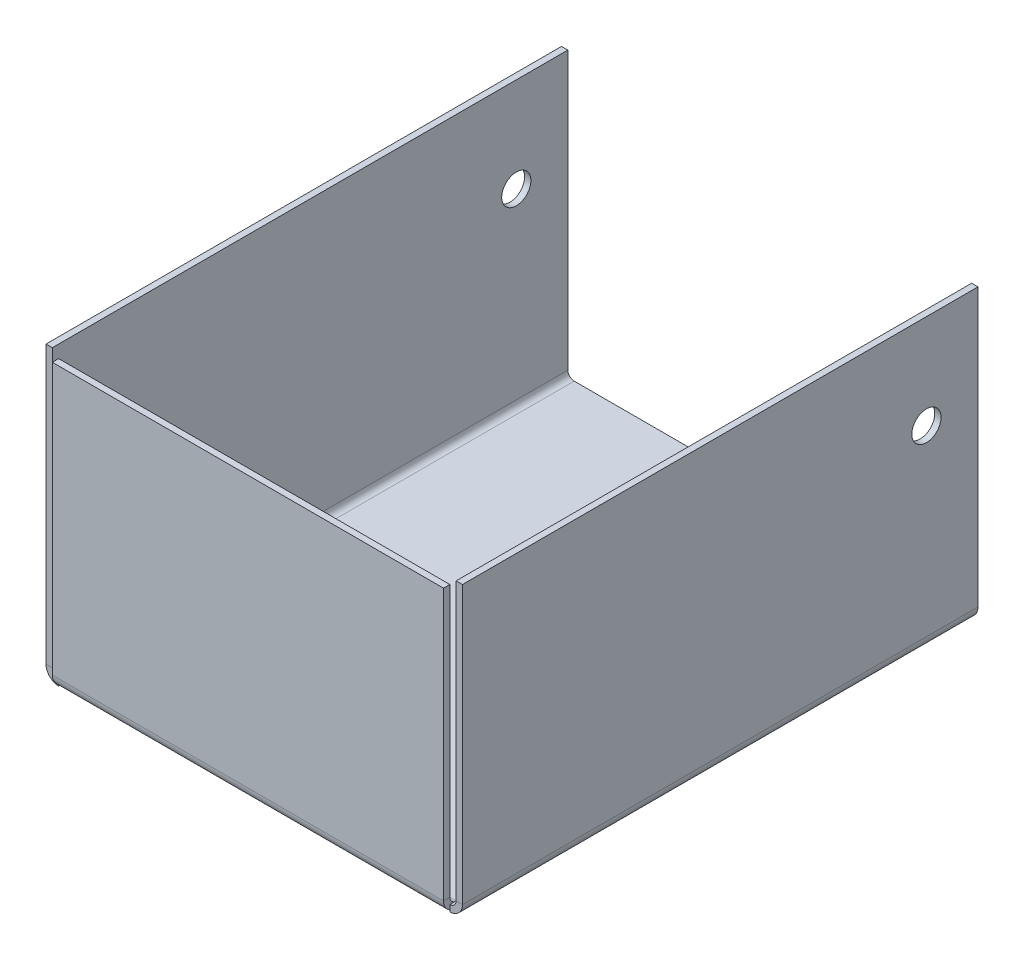
ISO-10303-21;
HEADER;
FILE_DESCRIPTION(('STEP AP214'),'2;1');
FILE_NAME('part.step','',(''),(''),'','','');
FILE_SCHEMA(('AUTOMOTIVE_DESIGN { 1 0 10303 214 1 1 1 1 }'));
ENDSEC;
DATA;
#1=APPLICATION_CONTEXT('core data for automotive mechanical design processes');
#2=APPLICATION_PROTOCOL_DEFINITION('international standard','automotive_design',2000,#1);
#3=PRODUCT_CONTEXT('',#1,'mechanical');
#4=PRODUCT('Part','Part','',(#3));
#5=PRODUCT_RELATED_PRODUCT_CATEGORY('part','',(#4));
#6=PRODUCT_DEFINITION_FORMATION('','',#4);
#7=PRODUCT_DEFINITION_CONTEXT('part definition',#1,'design');
#8=PRODUCT_DEFINITION('design','',#6,#7);
#9=PRODUCT_DEFINITION_SHAPE('','',#8);
#10=(LENGTH_UNIT() NAMED_UNIT(*) SI_UNIT(.MILLI.,.METRE.));
#11=(NAMED_UNIT(*) PLANE_ANGLE_UNIT() SI_UNIT($,.RADIAN.));
#12=(NAMED_UNIT(*) SI_UNIT($,.STERADIAN.) SOLID_ANGLE_UNIT());
#13=UNCERTAINTY_MEASURE_WITH_UNIT(LENGTH_MEASURE(1.E-05),#10,'distance_accuracy_value','');
#14=(GEOMETRIC_REPRESENTATION_CONTEXT(3) GLOBAL_UNCERTAINTY_ASSIGNED_CONTEXT((#13)) GLOBAL_UNIT_ASSIGNED_CONTEXT((#10,
#11,#12)) REPRESENTATION_CONTEXT('',''));
#15=CARTESIAN_POINT('',(0.,0.,0.));
#16=DIRECTION('',(0.,0.,1.));
#17=DIRECTION('',(1.,0.,0.));
#18=AXIS2_PLACEMENT_3D('',#15,#16,#17);
#19=CARTESIAN_POINT('',(22.7634,0.,30.));
#20=DIRECTION('',(-1.,0.,0.));
#21=DIRECTION('',(0.,0.,1.));
#22=AXIS2_PLACEMENT_3D('',#19,#20,#21);
#23=PLANE('',#22);
#24=DIRECTION('',(0.,1.,0.));
#25=VECTOR('',#24,1.);
#26=CARTESIAN_POINT('',(22.7634,-0.7366,30.));
#27=LINE('',#26,#25);
#28=CARTESIAN_POINT('',(22.7634,-0.7366,30.));
#29=VERTEX_POINT('',#28);
#30=CARTESIAN_POINT('',(22.7634,-0.539228624855236,30.));
#31=VERTEX_POINT('',#30);
#32=EDGE_CURVE('E350',#29,#31,#27,.T.);
#33=ORIENTED_EDGE('',*,*,#32,.T.);
#34=CARTESIAN_POINT('',(22.7634,0.736599999999997,29.2634));
#35=DIRECTION('',(1.,0.,0.));
#36=DIRECTION('',(0.,0.,-1.));
#37=AXIS2_PLACEMENT_3D('',#34,#35,#36);
#38=CIRCLE('',#37,1.4732);
#39=CARTESIAN_POINT('',(22.7634,-0.7366,29.2634));
#40=VERTEX_POINT('',#39);
#41=EDGE_CURVE('E11',#31,#40,#38,.T.);
#42=ORIENTED_EDGE('',*,*,#41,.T.);
#43=DIRECTION('',(0.,0.,-1.));
#44=VECTOR('',#43,1.);
#45=CARTESIAN_POINT('',(22.7634,-0.7366,30.));
#46=LINE('',#45,#44);
#47=EDGE_CURVE('E321',#29,#40,#46,.T.);
#48=ORIENTED_EDGE('',*,*,#47,.F.);
#49=EDGE_LOOP('',(#33,#42,#48));
#50=FACE_BOUND('',#49,.T.);
#51=ADVANCED_FACE('F41',(#50),#23,.T.);
#52=CARTESIAN_POINT('',(-22.7634,0.,29.2634));
#53=DIRECTION('',(1.,0.,0.));
#54=DIRECTION('',(0.,0.,-1.));
#55=AXIS2_PLACEMENT_3D('',#52,#53,#54);
#56=PLANE('',#55);
#57=DIRECTION('',(0.,0.,-1.));
#58=VECTOR('',#57,1.);
#59=CARTESIAN_POINT('',(-22.7634,-0.7366,30.));
#60=LINE('',#59,#58);
#61=CARTESIAN_POINT('',(-22.7634,-0.7366,30.));
#62=VERTEX_POINT('',#61);
#63=CARTESIAN_POINT('',(-22.7634,-0.7366,29.2634));
#64=VERTEX_POINT('',#63);
#65=EDGE_CURVE('E325',#62,#64,#60,.T.);
#66=ORIENTED_EDGE('',*,*,#65,.T.);
#67=CARTESIAN_POINT('',(-22.7634,0.736599999999997,29.2634));
#68=DIRECTION('',(1.,0.,0.));
#69=DIRECTION('',(0.,0.,-1.));
#70=AXIS2_PLACEMENT_3D('',#67,#68,#69);
#71=CIRCLE('',#70,1.4732);
#72=CARTESIAN_POINT('',(-22.7634,-0.539228624855236,30.));
#73=VERTEX_POINT('',#72);
#74=EDGE_CURVE('E230',#64,#73,#71,.F.);
#75=ORIENTED_EDGE('',*,*,#74,.T.);
#76=DIRECTION('',(0.,-1.,0.));
#77=VECTOR('',#76,1.);
#78=CARTESIAN_POINT('',(-22.7634,0.,30.));
#79=LINE('',#78,#77);
#80=EDGE_CURVE('E341',#73,#62,#79,.T.);
#81=ORIENTED_EDGE('',*,*,#80,.T.);
#82=EDGE_LOOP('',(#66,#75,#81));
#83=FACE_BOUND('',#82,.T.);
#84=ADVANCED_FACE('F400',(#83),#56,.T.);
#85=CARTESIAN_POINT('',(-23.5,-0.7366,30.));
#86=DIRECTION('',(0.,-1.,0.));
#87=DIRECTION('',(0.,0.,-1.));
#88=AXIS2_PLACEMENT_3D('',#85,#86,#87);
#89=PLANE('',#88);
#90=CARTESIAN_POINT('',(0.,-0.7366,-6.5));
#91=DIRECTION('',(0.,-1.,0.));
#92=DIRECTION('',(0.,0.,-1.));
#93=AXIS2_PLACEMENT_3D('',#90,#91,#92);
#94=CIRCLE('',#93,3.);
#95=CARTESIAN_POINT('',(0.,-0.7366,-9.5));
#96=VERTEX_POINT('',#95);
#97=EDGE_CURVE('E821',#96,#96,#94,.T.);
#98=ORIENTED_EDGE('',*,*,#97,.F.);
#99=EDGE_LOOP('',(#98));
#100=FACE_BOUND('',#99,.T.);
#101=CARTESIAN_POINT('',(22.7634,-0.7366,-30.));
#102=VERTEX_POINT('',#101);
#103=EDGE_CURVE('E320',#40,#102,#46,.T.);
#104=ORIENTED_EDGE('',*,*,#103,.F.);
#105=DIRECTION('',(1.,0.,0.));
#106=VECTOR('',#105,1.);
#107=CARTESIAN_POINT('',(22.7634,-0.7366,29.2634));
#108=LINE('',#107,#106);
#109=EDGE_CURVE('E184',#40,#64,#108,.F.);
#110=ORIENTED_EDGE('',*,*,#109,.T.);
#111=CARTESIAN_POINT('',(-22.7634,-0.7366,-30.));
#112=VERTEX_POINT('',#111);
#113=EDGE_CURVE('E324',#64,#112,#60,.T.);
#114=ORIENTED_EDGE('',*,*,#113,.T.);
#115=DIRECTION('',(1.,0.,0.));
#116=VECTOR('',#115,1.);
#117=CARTESIAN_POINT('',(-23.5,-0.7366,-30.));
#118=LINE('',#117,#116);
#119=EDGE_CURVE('E281',#102,#112,#118,.F.);
#120=ORIENTED_EDGE('',*,*,#119,.F.);
#121=EDGE_LOOP('',(#104,#110,#114,#120));
#122=FACE_BOUND('',#121,.T.);
#123=ADVANCED_FACE('F406',(#100,#122),#89,.T.);
#124=CARTESIAN_POINT('',(-23.5,0.,30.));
#125=DIRECTION('',(0.,-1.,0.));
#126=DIRECTION('',(0.,0.,-1.));
#127=AXIS2_PLACEMENT_3D('',#124,#125,#126);
#128=PLANE('',#127);
#129=CARTESIAN_POINT('',(0.,0.,-6.5));
#130=DIRECTION('',(0.,-1.,0.));
#131=DIRECTION('',(0.,0.,-1.));
#132=AXIS2_PLACEMENT_3D('',#129,#130,#131);
#133=CIRCLE('',#132,3.);
#134=CARTESIAN_POINT('',(0.,0.,-9.5));
#135=VERTEX_POINT('',#134);
#136=EDGE_CURVE('E45',#135,#135,#133,.T.);
#137=ORIENTED_EDGE('',*,*,#136,.T.);
#138=EDGE_LOOP('',(#137));
#139=FACE_BOUND('',#138,.T.);
#140=DIRECTION('',(1.,0.,0.));
#141=VECTOR('',#140,1.);
#142=CARTESIAN_POINT('',(22.7634,0.,29.2634));
#143=LINE('',#142,#141);
#144=CARTESIAN_POINT('',(22.7634,0.,29.2634));
#145=VERTEX_POINT('',#144);
#146=CARTESIAN_POINT('',(-22.7634,0.,29.2634));
#147=VERTEX_POINT('',#146);
#148=EDGE_CURVE('E236',#145,#147,#143,.F.);
#149=ORIENTED_EDGE('',*,*,#148,.F.);
#150=DIRECTION('',(0.,0.,-1.));
#151=VECTOR('',#150,1.);
#152=CARTESIAN_POINT('',(22.7634,0.,30.));
#153=LINE('',#152,#151);
#154=CARTESIAN_POINT('',(22.7634,0.,-30.));
#155=VERTEX_POINT('',#154);
#156=EDGE_CURVE('E307',#145,#155,#153,.T.);
#157=ORIENTED_EDGE('',*,*,#156,.T.);
#158=DIRECTION('',(-1.,0.,0.));
#159=VECTOR('',#158,1.);
#160=CARTESIAN_POINT('',(-23.5,0.,-30.));
#161=LINE('',#160,#159);
#162=CARTESIAN_POINT('',(-22.7634,0.,-30.));
#163=VERTEX_POINT('',#162);
#164=EDGE_CURVE('E299',#155,#163,#161,.T.);
#165=ORIENTED_EDGE('',*,*,#164,.T.);
#166=DIRECTION('',(0.,0.,-1.));
#167=VECTOR('',#166,1.);
#168=CARTESIAN_POINT('',(-22.7634,0.,30.));
#169=LINE('',#168,#167);
#170=EDGE_CURVE('E67',#147,#163,#169,.T.);
#171=ORIENTED_EDGE('',*,*,#170,.F.);
#172=EDGE_LOOP('',(#149,#157,#165,#171));
#173=FACE_BOUND('',#172,.T.);
#174=ADVANCED_FACE('F424',(#139,#173),#128,.F.);
#175=CARTESIAN_POINT('',(23.5,0.7366,30.));
#176=DIRECTION('',(0.,0.,1.));
#177=DIRECTION('',(1.,0.,0.));
#178=AXIS2_PLACEMENT_3D('',#175,#176,#177);
#179=PLANE('',#178);
#180=DIRECTION('',(1.,0.,0.));
#181=VECTOR('',#180,1.);
#182=CARTESIAN_POINT('',(23.5,0.7366,30.));
#183=LINE('',#182,#181);
#184=CARTESIAN_POINT('',(23.5,0.7366,30.));
#185=VERTEX_POINT('',#184);
#186=CARTESIAN_POINT('',(24.2366,0.7366,30.));
#187=VERTEX_POINT('',#186);
#188=EDGE_CURVE('E50',#185,#187,#183,.T.);
#189=ORIENTED_EDGE('',*,*,#188,.F.);
#190=CARTESIAN_POINT('',(22.7634,0.7366,30.));
#191=DIRECTION('',(0.,0.,1.));
#192=DIRECTION('',(1.,0.,0.));
#193=AXIS2_PLACEMENT_3D('',#190,#191,#192);
#194=CIRCLE('',#193,0.7366);
#195=CARTESIAN_POINT('',(22.7634,0.,30.));
#196=VERTEX_POINT('',#195);
#197=EDGE_CURVE('E264',#185,#196,#194,.F.);
#198=ORIENTED_EDGE('',*,*,#197,.T.);
#199=EDGE_CURVE('E59',#31,#196,#27,.T.);
#200=ORIENTED_EDGE('',*,*,#199,.F.);
#201=ORIENTED_EDGE('',*,*,#32,.F.);
#202=CARTESIAN_POINT('',(22.7634,0.7366,30.));
#203=DIRECTION('',(0.,0.,1.));
#204=DIRECTION('',(1.,0.,0.));
#205=AXIS2_PLACEMENT_3D('',#202,#203,#204);
#206=CIRCLE('',#205,1.4732);
#207=EDGE_CURVE('E252',#187,#29,#206,.F.);
#208=ORIENTED_EDGE('',*,*,#207,.F.);
#209=EDGE_LOOP('',(#189,#198,#200,#201,#208));
#210=FACE_BOUND('',#209,.T.);
#211=ADVANCED_FACE('F43',(#210),#179,.T.);
#212=CARTESIAN_POINT('',(22.7634,-0.7366,30.));
#213=DIRECTION('',(0.,0.,1.));
#214=DIRECTION('',(1.,0.,0.));
#215=AXIS2_PLACEMENT_3D('',#212,#213,#214);
#216=PLANE('',#215);
#217=DIRECTION('',(0.,-1.,0.));
#218=VECTOR('',#217,1.);
#219=CARTESIAN_POINT('',(23.5,0.,30.));
#220=LINE('',#219,#218);
#221=CARTESIAN_POINT('',(23.5,33.,30.));
#222=VERTEX_POINT('',#221);
#223=EDGE_CURVE('E261',#222,#185,#220,.T.);
#224=ORIENTED_EDGE('',*,*,#223,.T.);
#225=ORIENTED_EDGE('',*,*,#188,.T.);
#226=DIRECTION('',(0.,-1.,0.));
#227=VECTOR('',#226,1.);
#228=CARTESIAN_POINT('',(24.2366,0.,30.));
#229=LINE('',#228,#227);
#230=CARTESIAN_POINT('',(24.2366,33.,30.));
#231=VERTEX_POINT('',#230);
#232=EDGE_CURVE('E255',#231,#187,#229,.T.);
#233=ORIENTED_EDGE('',*,*,#232,.F.);
#234=DIRECTION('',(1.,0.,0.));
#235=VECTOR('',#234,1.);
#236=CARTESIAN_POINT('',(23.5,33.,30.));
#237=LINE('',#236,#235);
#238=EDGE_CURVE('E258',#222,#231,#237,.T.);
#239=ORIENTED_EDGE('',*,*,#238,.F.);
#240=EDGE_LOOP('',(#224,#225,#233,#239));
#241=FACE_BOUND('',#240,.T.);
#242=ADVANCED_FACE('F482',(#241),#216,.T.);
#243=CARTESIAN_POINT('',(22.7634,0.,-30.));
#244=DIRECTION('',(0.,0.,-1.));
#245=DIRECTION('',(-1.,0.,0.));
#246=AXIS2_PLACEMENT_3D('',#243,#244,#245);
#247=PLANE('',#246);
#248=DIRECTION('',(0.,-1.,0.));
#249=VECTOR('',#248,1.);
#250=CARTESIAN_POINT('',(22.7634,0.,-30.));
#251=LINE('',#250,#249);
#252=EDGE_CURVE('E347',#155,#102,#251,.T.);
#253=ORIENTED_EDGE('',*,*,#252,.F.);
#254=CARTESIAN_POINT('',(22.7634,0.7366,-30.));
#255=DIRECTION('',(0.,0.,1.));
#256=DIRECTION('',(1.,0.,0.));
#257=AXIS2_PLACEMENT_3D('',#254,#255,#256);
#258=CIRCLE('',#257,0.7366);
#259=CARTESIAN_POINT('',(23.5,0.7366,-30.));
#260=VERTEX_POINT('',#259);
#261=EDGE_CURVE('E296',#260,#155,#258,.F.);
#262=ORIENTED_EDGE('',*,*,#261,.F.);
#263=DIRECTION('',(-1.,0.,0.));
#264=VECTOR('',#263,1.);
#265=CARTESIAN_POINT('',(24.2366,0.7366,-30.));
#266=LINE('',#265,#264);
#267=CARTESIAN_POINT('',(24.2366,0.7366,-30.));
#268=VERTEX_POINT('',#267);
#269=EDGE_CURVE('E345',#268,#260,#266,.T.);
#270=ORIENTED_EDGE('',*,*,#269,.F.);
#271=CARTESIAN_POINT('',(22.7634,0.7366,-30.));
#272=DIRECTION('',(0.,0.,1.));
#273=DIRECTION('',(1.,0.,0.));
#274=AXIS2_PLACEMENT_3D('',#271,#272,#273);
#275=CIRCLE('',#274,1.4732);
#276=EDGE_CURVE('E284',#268,#102,#275,.F.);
#277=ORIENTED_EDGE('',*,*,#276,.T.);
#278=EDGE_LOOP('',(#253,#262,#270,#277));
#279=FACE_BOUND('',#278,.T.);
#280=ADVANCED_FACE('F479',(#279),#247,.T.);
#281=CARTESIAN_POINT('',(24.2366,0.7366,-30.));
#282=DIRECTION('',(0.,0.,-1.));
#283=DIRECTION('',(-1.,0.,0.));
#284=AXIS2_PLACEMENT_3D('',#281,#282,#283);
#285=PLANE('',#284);
#286=ORIENTED_EDGE('',*,*,#164,.F.);
#287=ORIENTED_EDGE('',*,*,#252,.T.);
#288=ORIENTED_EDGE('',*,*,#119,.T.);
#289=DIRECTION('',(0.,1.,0.));
#290=VECTOR('',#289,1.);
#291=CARTESIAN_POINT('',(-22.7634,-0.7366,-30.));
#292=LINE('',#291,#290);
#293=EDGE_CURVE('E334',#112,#163,#292,.T.);
#294=ORIENTED_EDGE('',*,*,#293,.T.);
#295=EDGE_LOOP('',(#286,#287,#288,#294));
#296=FACE_BOUND('',#295,.T.);
#297=ADVANCED_FACE('F475',(#296),#285,.T.);
#298=CARTESIAN_POINT('',(-22.7634,0.,30.));
#299=DIRECTION('',(0.,0.,1.));
#300=DIRECTION('',(1.,0.,0.));
#301=AXIS2_PLACEMENT_3D('',#298,#299,#300);
#302=PLANE('',#301);
#303=CARTESIAN_POINT('',(-22.7634,0.,30.));
#304=VERTEX_POINT('',#303);
#305=EDGE_CURVE('E342',#304,#73,#79,.T.);
#306=ORIENTED_EDGE('',*,*,#305,.F.);
#307=CARTESIAN_POINT('',(-22.7634,0.7366,30.));
#308=DIRECTION('',(0.,0.,1.));
#309=DIRECTION('',(1.,0.,0.));
#310=AXIS2_PLACEMENT_3D('',#307,#308,#309);
#311=CIRCLE('',#310,0.7366);
#312=CARTESIAN_POINT('',(-23.5,0.7366,30.));
#313=VERTEX_POINT('',#312);
#314=EDGE_CURVE('E266',#304,#313,#311,.F.);
#315=ORIENTED_EDGE('',*,*,#314,.T.);
#316=DIRECTION('',(1.,0.,0.));
#317=VECTOR('',#316,1.);
#318=CARTESIAN_POINT('',(-24.2366,0.7366,30.));
#319=LINE('',#318,#317);
#320=CARTESIAN_POINT('',(-24.2366,0.7366,30.));
#321=VERTEX_POINT('',#320);
#322=EDGE_CURVE('E339',#321,#313,#319,.T.);
#323=ORIENTED_EDGE('',*,*,#322,.F.);
#324=CARTESIAN_POINT('',(-22.7634,0.7366,30.));
#325=DIRECTION('',(0.,0.,1.));
#326=DIRECTION('',(1.,0.,0.));
#327=AXIS2_PLACEMENT_3D('',#324,#325,#326);
#328=CIRCLE('',#327,1.4732);
#329=EDGE_CURVE('E249',#62,#321,#328,.F.);
#330=ORIENTED_EDGE('',*,*,#329,.F.);
#331=ORIENTED_EDGE('',*,*,#80,.F.);
#332=EDGE_LOOP('',(#306,#315,#323,#330,#331));
#333=FACE_BOUND('',#332,.T.);
#334=ADVANCED_FACE('F471',(#333),#302,.T.);
#335=CARTESIAN_POINT('',(-23.5,0.7366,-30.));
#336=DIRECTION('',(0.,0.,-1.));
#337=DIRECTION('',(-1.,0.,0.));
#338=AXIS2_PLACEMENT_3D('',#335,#336,#337);
#339=PLANE('',#338);
#340=DIRECTION('',(-1.,0.,0.));
#341=VECTOR('',#340,1.);
#342=CARTESIAN_POINT('',(-23.5,0.7366,-30.));
#343=LINE('',#342,#341);
#344=CARTESIAN_POINT('',(-23.5,0.7366,-30.));
#345=VERTEX_POINT('',#344);
#346=CARTESIAN_POINT('',(-24.2366,0.7366,-30.));
#347=VERTEX_POINT('',#346);
#348=EDGE_CURVE('E337',#345,#347,#343,.T.);
#349=ORIENTED_EDGE('',*,*,#348,.F.);
#350=CARTESIAN_POINT('',(-22.7634,0.7366,-30.));
#351=DIRECTION('',(0.,0.,1.));
#352=DIRECTION('',(1.,0.,0.));
#353=AXIS2_PLACEMENT_3D('',#350,#351,#352);
#354=CIRCLE('',#353,0.7366);
#355=EDGE_CURVE('E243',#163,#345,#354,.F.);
#356=ORIENTED_EDGE('',*,*,#355,.F.);
#357=ORIENTED_EDGE('',*,*,#293,.F.);
#358=CARTESIAN_POINT('',(-22.7634,0.7366,-30.));
#359=DIRECTION('',(0.,0.,1.));
#360=DIRECTION('',(1.,0.,0.));
#361=AXIS2_PLACEMENT_3D('',#358,#359,#360);
#362=CIRCLE('',#361,1.4732);
#363=EDGE_CURVE('E278',#112,#347,#362,.F.);
#364=ORIENTED_EDGE('',*,*,#363,.T.);
#365=EDGE_LOOP('',(#349,#356,#357,#364));
#366=FACE_BOUND('',#365,.T.);
#367=ADVANCED_FACE('F467',(#366),#339,.T.);
#368=CARTESIAN_POINT('',(-22.7634,-0.7366,-30.));
#369=DIRECTION('',(0.,0.,-1.));
#370=DIRECTION('',(-1.,0.,0.));
#371=AXIS2_PLACEMENT_3D('',#368,#369,#370);
#372=PLANE('',#371);
#373=DIRECTION('',(0.,1.,0.));
#374=VECTOR('',#373,1.);
#375=CARTESIAN_POINT('',(-23.5,0.,-30.));
#376=LINE('',#375,#374);
#377=CARTESIAN_POINT('',(-23.5,33.,-30.));
#378=VERTEX_POINT('',#377);
#379=EDGE_CURVE('E232',#345,#378,#376,.T.);
#380=ORIENTED_EDGE('',*,*,#379,.F.);
#381=ORIENTED_EDGE('',*,*,#348,.T.);
#382=DIRECTION('',(0.,1.,0.));
#383=VECTOR('',#382,1.);
#384=CARTESIAN_POINT('',(-24.2366,0.,-30.));
#385=LINE('',#384,#383);
#386=CARTESIAN_POINT('',(-24.2366,33.,-30.));
#387=VERTEX_POINT('',#386);
#388=EDGE_CURVE('E275',#347,#387,#385,.T.);
#389=ORIENTED_EDGE('',*,*,#388,.T.);
#390=DIRECTION('',(1.,0.,0.));
#391=VECTOR('',#390,1.);
#392=CARTESIAN_POINT('',(-24.2366,33.,-30.));
#393=LINE('',#392,#391);
#394=EDGE_CURVE('E272',#387,#378,#393,.T.);
#395=ORIENTED_EDGE('',*,*,#394,.T.);
#396=EDGE_LOOP('',(#380,#381,#389,#395));
#397=FACE_BOUND('',#396,.T.);
#398=ADVANCED_FACE('F463',(#397),#372,.T.);
#399=CARTESIAN_POINT('',(-23.5,0.,30.));
#400=DIRECTION('',(-1.,0.,0.));
#401=DIRECTION('',(0.,-1.,0.));
#402=AXIS2_PLACEMENT_3D('',#399,#400,#401);
#403=PLANE('',#402);
#404=CARTESIAN_POINT('',(-23.5,22.,-24.));
#405=DIRECTION('',(-1.,0.,0.));
#406=DIRECTION('',(0.,-1.,0.));
#407=AXIS2_PLACEMENT_3D('',#404,#405,#406);
#408=CIRCLE('',#407,1.69999999999999);
#409=CARTESIAN_POINT('',(-23.5,20.3,-24.));
#410=VERTEX_POINT('',#409);
#411=EDGE_CURVE('E354',#410,#410,#408,.T.);
#412=ORIENTED_EDGE('',*,*,#411,.T.);
#413=EDGE_LOOP('',(#412));
#414=FACE_BOUND('',#413,.T.);
#415=ORIENTED_EDGE('',*,*,#379,.T.);
#416=DIRECTION('',(0.,0.,-1.));
#417=VECTOR('',#416,1.);
#418=CARTESIAN_POINT('',(-23.5,33.,30.));
#419=LINE('',#418,#417);
#420=CARTESIAN_POINT('',(-23.5,33.,30.));
#421=VERTEX_POINT('',#420);
#422=EDGE_CURVE('E332',#421,#378,#419,.T.);
#423=ORIENTED_EDGE('',*,*,#422,.F.);
#424=DIRECTION('',(0.,1.,0.));
#425=VECTOR('',#424,1.);
#426=CARTESIAN_POINT('',(-23.5,0.,30.));
#427=LINE('',#426,#425);
#428=EDGE_CURVE('E240',#313,#421,#427,.T.);
#429=ORIENTED_EDGE('',*,*,#428,.F.);
#430=DIRECTION('',(0.,0.,-1.));
#431=VECTOR('',#430,1.);
#432=CARTESIAN_POINT('',(-23.5,0.7366,30.));
#433=LINE('',#432,#431);
#434=EDGE_CURVE('E269',#313,#345,#433,.T.);
#435=ORIENTED_EDGE('',*,*,#434,.T.);
#436=EDGE_LOOP('',(#415,#423,#429,#435));
#437=FACE_BOUND('',#436,.T.);
#438=ADVANCED_FACE('F459',(#414,#437),#403,.F.);
#439=CARTESIAN_POINT('',(-24.2366,33.,30.));
#440=DIRECTION('',(0.,1.,0.));
#441=DIRECTION('',(0.,0.,1.));
#442=AXIS2_PLACEMENT_3D('',#439,#440,#441);
#443=PLANE('',#442);
#444=ORIENTED_EDGE('',*,*,#394,.F.);
#445=DIRECTION('',(0.,0.,-1.));
#446=VECTOR('',#445,1.);
#447=CARTESIAN_POINT('',(-24.2366,33.,30.));
#448=LINE('',#447,#446);
#449=CARTESIAN_POINT('',(-24.2366,33.,30.));
#450=VERTEX_POINT('',#449);
#451=EDGE_CURVE('E330',#450,#387,#448,.T.);
#452=ORIENTED_EDGE('',*,*,#451,.F.);
#453=DIRECTION('',(1.,0.,0.));
#454=VECTOR('',#453,1.);
#455=CARTESIAN_POINT('',(-24.2366,33.,30.));
#456=LINE('',#455,#454);
#457=EDGE_CURVE('E242',#450,#421,#456,.T.);
#458=ORIENTED_EDGE('',*,*,#457,.T.);
#459=ORIENTED_EDGE('',*,*,#422,.T.);
#460=EDGE_LOOP('',(#444,#452,#458,#459));
#461=FACE_BOUND('',#460,.T.);
#462=ADVANCED_FACE('F456',(#461),#443,.T.);
#463=CARTESIAN_POINT('',(-24.2366,0.,30.));
#464=DIRECTION('',(-1.,0.,0.));
#465=DIRECTION('',(0.,-1.,0.));
#466=AXIS2_PLACEMENT_3D('',#463,#464,#465);
#467=PLANE('',#466);
#468=CARTESIAN_POINT('',(-24.2366,22.,-24.));
#469=DIRECTION('',(1.,0.,0.));
#470=DIRECTION('',(0.,0.,-1.));
#471=AXIS2_PLACEMENT_3D('',#468,#469,#470);
#472=CIRCLE('',#471,1.69999999999999);
#473=CARTESIAN_POINT('',(-24.2366,22.,-25.7));
#474=VERTEX_POINT('',#473);
#475=EDGE_CURVE('E355',#474,#474,#472,.T.);
#476=ORIENTED_EDGE('',*,*,#475,.T.);
#477=EDGE_LOOP('',(#476));
#478=FACE_BOUND('',#477,.T.);
#479=ORIENTED_EDGE('',*,*,#388,.F.);
#480=DIRECTION('',(0.,0.,-1.));
#481=VECTOR('',#480,1.);
#482=CARTESIAN_POINT('',(-24.2366,0.7366,30.));
#483=LINE('',#482,#481);
#484=EDGE_CURVE('E327',#321,#347,#483,.T.);
#485=ORIENTED_EDGE('',*,*,#484,.F.);
#486=DIRECTION('',(0.,1.,0.));
#487=VECTOR('',#486,1.);
#488=CARTESIAN_POINT('',(-24.2366,0.,30.));
#489=LINE('',#488,#487);
#490=EDGE_CURVE('E246',#321,#450,#489,.T.);
#491=ORIENTED_EDGE('',*,*,#490,.T.);
#492=ORIENTED_EDGE('',*,*,#451,.T.);
#493=EDGE_LOOP('',(#479,#485,#491,#492));
#494=FACE_BOUND('',#493,.T.);
#495=ADVANCED_FACE('F452',(#478,#494),#467,.T.);
#496=CARTESIAN_POINT('',(-22.7634,0.7366,30.));
#497=DIRECTION('',(0.,0.,-1.));
#498=DIRECTION('',(-1.,0.,0.));
#499=AXIS2_PLACEMENT_3D('',#496,#497,#498);
#500=CYLINDRICAL_SURFACE('',#499,1.4732);
#501=ORIENTED_EDGE('',*,*,#363,.F.);
#502=ORIENTED_EDGE('',*,*,#113,.F.);
#503=ORIENTED_EDGE('',*,*,#65,.F.);
#504=ORIENTED_EDGE('',*,*,#329,.T.);
#505=ORIENTED_EDGE('',*,*,#484,.T.);
#506=EDGE_LOOP('',(#501,#502,#503,#504,#505));
#507=FACE_BOUND('',#506,.T.);
#508=ADVANCED_FACE('F445',(#507),#500,.T.);
#509=CARTESIAN_POINT('',(22.7634,0.7366,30.));
#510=DIRECTION('',(0.,0.,-1.));
#511=DIRECTION('',(-1.,0.,0.));
#512=AXIS2_PLACEMENT_3D('',#509,#510,#511);
#513=CYLINDRICAL_SURFACE('',#512,1.4732);
#514=ORIENTED_EDGE('',*,*,#276,.F.);
#515=DIRECTION('',(0.,0.,-1.));
#516=VECTOR('',#515,1.);
#517=CARTESIAN_POINT('',(24.2366,0.7366,30.));
#518=LINE('',#517,#516);
#519=EDGE_CURVE('E317',#187,#268,#518,.T.);
#520=ORIENTED_EDGE('',*,*,#519,.F.);
#521=ORIENTED_EDGE('',*,*,#207,.T.);
#522=ORIENTED_EDGE('',*,*,#47,.T.);
#523=ORIENTED_EDGE('',*,*,#103,.T.);
#524=EDGE_LOOP('',(#514,#520,#521,#522,#523));
#525=FACE_BOUND('',#524,.T.);
#526=ADVANCED_FACE('F441',(#525),#513,.T.);
#527=CARTESIAN_POINT('',(24.2366,0.,30.));
#528=DIRECTION('',(1.,0.,0.));
#529=DIRECTION('',(0.,1.,0.));
#530=AXIS2_PLACEMENT_3D('',#527,#528,#529);
#531=PLANE('',#530);
#532=CARTESIAN_POINT('',(24.2366,22.,-24.));
#533=DIRECTION('',(1.,0.,0.));
#534=DIRECTION('',(0.,0.,-1.));
#535=AXIS2_PLACEMENT_3D('',#532,#533,#534);
#536=CIRCLE('',#535,1.69999999999999);
#537=CARTESIAN_POINT('',(24.2366,22.,-25.7));
#538=VERTEX_POINT('',#537);
#539=EDGE_CURVE('E362',#538,#538,#536,.T.);
#540=ORIENTED_EDGE('',*,*,#539,.F.);
#541=EDGE_LOOP('',(#540));
#542=FACE_BOUND('',#541,.T.);
#543=DIRECTION('',(0.,-1.,0.));
#544=VECTOR('',#543,1.);
#545=CARTESIAN_POINT('',(24.2366,0.,-30.));
#546=LINE('',#545,#544);
#547=CARTESIAN_POINT('',(24.2366,33.,-30.));
#548=VERTEX_POINT('',#547);
#549=EDGE_CURVE('E287',#548,#268,#546,.T.);
#550=ORIENTED_EDGE('',*,*,#549,.F.);
#551=DIRECTION('',(0.,0.,-1.));
#552=VECTOR('',#551,1.);
#553=CARTESIAN_POINT('',(24.2366,33.,30.));
#554=LINE('',#553,#552);
#555=EDGE_CURVE('E315',#231,#548,#554,.T.);
#556=ORIENTED_EDGE('',*,*,#555,.F.);
#557=ORIENTED_EDGE('',*,*,#232,.T.);
#558=ORIENTED_EDGE('',*,*,#519,.T.);
#559=EDGE_LOOP('',(#550,#556,#557,#558));
#560=FACE_BOUND('',#559,.T.);
#561=ADVANCED_FACE('F437',(#542,#560),#531,.T.);
#562=CARTESIAN_POINT('',(23.5,33.,30.));
#563=DIRECTION('',(0.,1.,0.));
#564=DIRECTION('',(0.,0.,1.));
#565=AXIS2_PLACEMENT_3D('',#562,#563,#564);
#566=PLANE('',#565);
#567=DIRECTION('',(1.,0.,0.));
#568=VECTOR('',#567,1.);
#569=CARTESIAN_POINT('',(23.5,33.,-30.));
#570=LINE('',#569,#568);
#571=CARTESIAN_POINT('',(23.5,33.,-30.));
#572=VERTEX_POINT('',#571);
#573=EDGE_CURVE('E290',#572,#548,#570,.T.);
#574=ORIENTED_EDGE('',*,*,#573,.F.);
#575=DIRECTION('',(0.,0.,-1.));
#576=VECTOR('',#575,1.);
#577=CARTESIAN_POINT('',(23.5,33.,30.));
#578=LINE('',#577,#576);
#579=EDGE_CURVE('E313',#222,#572,#578,.T.);
#580=ORIENTED_EDGE('',*,*,#579,.F.);
#581=ORIENTED_EDGE('',*,*,#238,.T.);
#582=ORIENTED_EDGE('',*,*,#555,.T.);
#583=EDGE_LOOP('',(#574,#580,#581,#582));
#584=FACE_BOUND('',#583,.T.);
#585=ADVANCED_FACE('F434',(#584),#566,.T.);
#586=CARTESIAN_POINT('',(23.5,0.,30.));
#587=DIRECTION('',(1.,0.,0.));
#588=DIRECTION('',(0.,1.,0.));
#589=AXIS2_PLACEMENT_3D('',#586,#587,#588);
#590=PLANE('',#589);
#591=CARTESIAN_POINT('',(23.5,22.,-24.));
#592=DIRECTION('',(1.,0.,0.));
#593=DIRECTION('',(0.,1.,0.));
#594=AXIS2_PLACEMENT_3D('',#591,#592,#593);
#595=CIRCLE('',#594,1.69999999999999);
#596=CARTESIAN_POINT('',(23.5,23.7,-24.));
#597=VERTEX_POINT('',#596);
#598=EDGE_CURVE('E352',#597,#597,#595,.T.);
#599=ORIENTED_EDGE('',*,*,#598,.T.);
#600=EDGE_LOOP('',(#599));
#601=FACE_BOUND('',#600,.T.);
#602=DIRECTION('',(0.,-1.,0.));
#603=VECTOR('',#602,1.);
#604=CARTESIAN_POINT('',(23.5,0.,-30.));
#605=LINE('',#604,#603);
#606=EDGE_CURVE('E293',#572,#260,#605,.T.);
#607=ORIENTED_EDGE('',*,*,#606,.T.);
#608=DIRECTION('',(0.,0.,-1.));
#609=VECTOR('',#608,1.);
#610=CARTESIAN_POINT('',(23.5,0.7366,30.));
#611=LINE('',#610,#609);
#612=EDGE_CURVE('E310',#185,#260,#611,.T.);
#613=ORIENTED_EDGE('',*,*,#612,.F.);
#614=ORIENTED_EDGE('',*,*,#223,.F.);
#615=ORIENTED_EDGE('',*,*,#579,.T.);
#616=EDGE_LOOP('',(#607,#613,#614,#615));
#617=FACE_BOUND('',#616,.T.);
#618=ADVANCED_FACE('F430',(#601,#617),#590,.F.);
#619=CARTESIAN_POINT('',(22.7634,0.7366,30.));
#620=DIRECTION('',(0.,0.,-1.));
#621=DIRECTION('',(-1.,0.,0.));
#622=AXIS2_PLACEMENT_3D('',#619,#620,#621);
#623=CYLINDRICAL_SURFACE('',#622,0.7366);
#624=ORIENTED_EDGE('',*,*,#261,.T.);
#625=ORIENTED_EDGE('',*,*,#156,.F.);
#626=EDGE_CURVE('E308',#196,#145,#153,.T.);
#627=ORIENTED_EDGE('',*,*,#626,.F.);
#628=ORIENTED_EDGE('',*,*,#197,.F.);
#629=ORIENTED_EDGE('',*,*,#612,.T.);
#630=EDGE_LOOP('',(#624,#625,#627,#628,#629));
#631=FACE_BOUND('',#630,.T.);
#632=ADVANCED_FACE('F422',(#631),#623,.F.);
#633=CARTESIAN_POINT('',(-22.7634,0.7366,30.));
#634=DIRECTION('',(0.,0.,-1.));
#635=DIRECTION('',(-1.,0.,0.));
#636=AXIS2_PLACEMENT_3D('',#633,#634,#635);
#637=CYLINDRICAL_SURFACE('',#636,0.7366);
#638=ORIENTED_EDGE('',*,*,#355,.T.);
#639=ORIENTED_EDGE('',*,*,#434,.F.);
#640=ORIENTED_EDGE('',*,*,#314,.F.);
#641=EDGE_CURVE('E305',#304,#147,#169,.T.);
#642=ORIENTED_EDGE('',*,*,#641,.T.);
#643=ORIENTED_EDGE('',*,*,#170,.T.);
#644=EDGE_LOOP('',(#638,#639,#640,#642,#643));
#645=FACE_BOUND('',#644,.T.);
#646=ADVANCED_FACE('F415',(#645),#637,.F.);
#647=CARTESIAN_POINT('',(-22.7634,0.7366,30.));
#648=DIRECTION('',(0.,0.,1.));
#649=DIRECTION('',(1.,0.,0.));
#650=AXIS2_PLACEMENT_3D('',#647,#648,#649);
#651=PLANE('',#650);
#652=ORIENTED_EDGE('',*,*,#428,.T.);
#653=ORIENTED_EDGE('',*,*,#457,.F.);
#654=ORIENTED_EDGE('',*,*,#490,.F.);
#655=ORIENTED_EDGE('',*,*,#322,.T.);
#656=EDGE_LOOP('',(#652,#653,#654,#655));
#657=FACE_BOUND('',#656,.T.);
#658=ADVANCED_FACE('F411',(#657),#651,.T.);
#659=CARTESIAN_POINT('',(-22.7634,0.7366,-30.));
#660=DIRECTION('',(0.,0.,1.));
#661=DIRECTION('',(1.,0.,0.));
#662=AXIS2_PLACEMENT_3D('',#659,#660,#661);
#663=PLANE('',#662);
#664=ORIENTED_EDGE('',*,*,#549,.T.);
#665=ORIENTED_EDGE('',*,*,#269,.T.);
#666=ORIENTED_EDGE('',*,*,#606,.F.);
#667=ORIENTED_EDGE('',*,*,#573,.T.);
#668=EDGE_LOOP('',(#664,#665,#666,#667));
#669=FACE_BOUND('',#668,.T.);
#670=ADVANCED_FACE('F414',(#669),#663,.F.);
#671=CARTESIAN_POINT('',(-22.7634,0.736599999999997,29.2634));
#672=DIRECTION('',(-1.,0.,0.));
#673=DIRECTION('',(0.,0.,1.));
#674=AXIS2_PLACEMENT_3D('',#671,#672,#673);
#675=PLANE('',#674);
#676=ORIENTED_EDGE('',*,*,#641,.F.);
#677=ORIENTED_EDGE('',*,*,#305,.T.);
#678=CARTESIAN_POINT('',(-22.7634,0.736599999999997,30.7366));
#679=VERTEX_POINT('',#678);
#680=EDGE_CURVE('E229',#73,#679,#71,.F.);
#681=ORIENTED_EDGE('',*,*,#680,.T.);
#682=DIRECTION('',(0.,0.,1.));
#683=VECTOR('',#682,1.);
#684=CARTESIAN_POINT('',(-22.7634,0.736599999999997,30.));
#685=LINE('',#684,#683);
#686=CARTESIAN_POINT('',(-22.7634,0.736599999999997,30.));
#687=VERTEX_POINT('',#686);
#688=EDGE_CURVE('E359',#687,#679,#685,.T.);
#689=ORIENTED_EDGE('',*,*,#688,.F.);
#690=CARTESIAN_POINT('',(-22.7634,0.736599999999997,29.2634));
#691=DIRECTION('',(1.,0.,0.));
#692=DIRECTION('',(0.,0.,-1.));
#693=AXIS2_PLACEMENT_3D('',#690,#691,#692);
#694=CIRCLE('',#693,0.736599999999997);
#695=EDGE_CURVE('E185',#147,#687,#694,.F.);
#696=ORIENTED_EDGE('',*,*,#695,.F.);
#697=EDGE_LOOP('',(#676,#677,#681,#689,#696));
#698=FACE_BOUND('',#697,.T.);
#699=ADVANCED_FACE('F376',(#698),#675,.T.);
#700=CARTESIAN_POINT('',(22.7634,0.736599999999997,29.2634));
#701=DIRECTION('',(-1.,0.,0.));
#702=DIRECTION('',(0.,0.,1.));
#703=AXIS2_PLACEMENT_3D('',#700,#701,#702);
#704=PLANE('',#703);
#705=CARTESIAN_POINT('',(22.7634,0.736599999999997,30.7366));
#706=VERTEX_POINT('',#705);
#707=EDGE_CURVE('E52',#706,#31,#38,.T.);
#708=ORIENTED_EDGE('',*,*,#707,.T.);
#709=ORIENTED_EDGE('',*,*,#199,.T.);
#710=ORIENTED_EDGE('',*,*,#626,.T.);
#711=CARTESIAN_POINT('',(22.7634,0.736599999999997,29.2634));
#712=DIRECTION('',(1.,0.,0.));
#713=DIRECTION('',(0.,0.,-1.));
#714=AXIS2_PLACEMENT_3D('',#711,#712,#713);
#715=CIRCLE('',#714,0.736599999999997);
#716=CARTESIAN_POINT('',(22.7634,0.736599999999997,30.));
#717=VERTEX_POINT('',#716);
#718=EDGE_CURVE('E192',#717,#145,#715,.T.);
#719=ORIENTED_EDGE('',*,*,#718,.F.);
#720=DIRECTION('',(0.,0.,1.));
#721=VECTOR('',#720,1.);
#722=CARTESIAN_POINT('',(22.7634,0.736599999999997,30.));
#723=LINE('',#722,#721);
#724=EDGE_CURVE('E188',#717,#706,#723,.T.);
#725=ORIENTED_EDGE('',*,*,#724,.T.);
#726=EDGE_LOOP('',(#708,#709,#710,#719,#725));
#727=FACE_BOUND('',#726,.T.);
#728=ADVANCED_FACE('F189',(#727),#704,.F.);
#729=CARTESIAN_POINT('',(22.7634,0.736599999999997,29.2634));
#730=DIRECTION('',(1.,0.,0.));
#731=DIRECTION('',(0.,0.,1.));
#732=AXIS2_PLACEMENT_3D('',#729,#730,#731);
#733=CYLINDRICAL_SURFACE('',#732,1.4732);
#734=ORIENTED_EDGE('',*,*,#109,.F.);
#735=ORIENTED_EDGE('',*,*,#41,.F.);
#736=ORIENTED_EDGE('',*,*,#707,.F.);
#737=DIRECTION('',(-1.,0.,0.));
#738=VECTOR('',#737,1.);
#739=CARTESIAN_POINT('',(0.,0.736599999999997,30.7366));
#740=LINE('',#739,#738);
#741=EDGE_CURVE('E181',#706,#679,#740,.T.);
#742=ORIENTED_EDGE('',*,*,#741,.T.);
#743=ORIENTED_EDGE('',*,*,#680,.F.);
#744=ORIENTED_EDGE('',*,*,#74,.F.);
#745=EDGE_LOOP('',(#734,#735,#736,#742,#743,#744));
#746=FACE_BOUND('',#745,.T.);
#747=ADVANCED_FACE('F178',(#746),#733,.T.);
#748=CARTESIAN_POINT('',(22.7634,0.736599999999997,29.2634));
#749=DIRECTION('',(1.,0.,0.));
#750=DIRECTION('',(0.,0.,1.));
#751=AXIS2_PLACEMENT_3D('',#748,#749,#750);
#752=CYLINDRICAL_SURFACE('',#751,0.736599999999997);
#753=ORIENTED_EDGE('',*,*,#148,.T.);
#754=ORIENTED_EDGE('',*,*,#695,.T.);
#755=DIRECTION('',(1.,0.,0.));
#756=VECTOR('',#755,1.);
#757=CARTESIAN_POINT('',(-22.7634,0.736599999999997,30.));
#758=LINE('',#757,#756);
#759=EDGE_CURVE('E196',#687,#717,#758,.T.);
#760=ORIENTED_EDGE('',*,*,#759,.T.);
#761=ORIENTED_EDGE('',*,*,#718,.T.);
#762=EDGE_LOOP('',(#753,#754,#760,#761));
#763=FACE_BOUND('',#762,.T.);
#764=ADVANCED_FACE('F379',(#763),#752,.F.);
#765=CARTESIAN_POINT('',(22.7634,32.2634,30.7366));
#766=DIRECTION('',(-1.,0.,0.));
#767=DIRECTION('',(0.,-1.,0.));
#768=AXIS2_PLACEMENT_3D('',#765,#766,#767);
#769=PLANE('',#768);
#770=ORIENTED_EDGE('',*,*,#724,.F.);
#771=DIRECTION('',(0.,1.,0.));
#772=VECTOR('',#771,1.);
#773=CARTESIAN_POINT('',(22.7634,32.2634,30.));
#774=LINE('',#773,#772);
#775=CARTESIAN_POINT('',(22.7634,32.2634,30.));
#776=VERTEX_POINT('',#775);
#777=EDGE_CURVE('E205',#717,#776,#774,.T.);
#778=ORIENTED_EDGE('',*,*,#777,.T.);
#779=DIRECTION('',(0.,0.,-1.));
#780=VECTOR('',#779,1.);
#781=CARTESIAN_POINT('',(22.7634,32.2634,30.7366));
#782=LINE('',#781,#780);
#783=CARTESIAN_POINT('',(22.7634,32.2634,30.7366));
#784=VERTEX_POINT('',#783);
#785=EDGE_CURVE('E209',#784,#776,#782,.T.);
#786=ORIENTED_EDGE('',*,*,#785,.F.);
#787=DIRECTION('',(0.,1.,0.));
#788=VECTOR('',#787,1.);
#789=CARTESIAN_POINT('',(22.7634,32.2634,30.7366));
#790=LINE('',#789,#788);
#791=EDGE_CURVE('E201',#706,#784,#790,.T.);
#792=ORIENTED_EDGE('',*,*,#791,.F.);
#793=EDGE_LOOP('',(#770,#778,#786,#792));
#794=FACE_BOUND('',#793,.T.);
#795=ADVANCED_FACE('F207',(#794),#769,.F.);
#796=CARTESIAN_POINT('',(-22.7634,0.,30.7366));
#797=DIRECTION('',(1.,0.,0.));
#798=DIRECTION('',(0.,0.,-1.));
#799=AXIS2_PLACEMENT_3D('',#796,#797,#798);
#800=PLANE('',#799);
#801=ORIENTED_EDGE('',*,*,#688,.T.);
#802=DIRECTION('',(0.,-1.,0.));
#803=VECTOR('',#802,1.);
#804=CARTESIAN_POINT('',(-22.7634,0.,30.7366));
#805=LINE('',#804,#803);
#806=CARTESIAN_POINT('',(-22.7634,32.2634,30.7366));
#807=VERTEX_POINT('',#806);
#808=EDGE_CURVE('E204',#807,#679,#805,.T.);
#809=ORIENTED_EDGE('',*,*,#808,.F.);
#810=DIRECTION('',(0.,0.,-1.));
#811=VECTOR('',#810,1.);
#812=CARTESIAN_POINT('',(-22.7634,32.2634,30.7366));
#813=LINE('',#812,#811);
#814=CARTESIAN_POINT('',(-22.7634,32.2634,30.));
#815=VERTEX_POINT('',#814);
#816=EDGE_CURVE('E221',#807,#815,#813,.T.);
#817=ORIENTED_EDGE('',*,*,#816,.T.);
#818=DIRECTION('',(0.,-1.,0.));
#819=VECTOR('',#818,1.);
#820=CARTESIAN_POINT('',(-22.7634,0.,30.));
#821=LINE('',#820,#819);
#822=EDGE_CURVE('E212',#815,#687,#821,.T.);
#823=ORIENTED_EDGE('',*,*,#822,.T.);
#824=EDGE_LOOP('',(#801,#809,#817,#823));
#825=FACE_BOUND('',#824,.T.);
#826=ADVANCED_FACE('F371',(#825),#800,.F.);
#827=CARTESIAN_POINT('',(0.,0.,30.7366));
#828=DIRECTION('',(0.,0.,-1.));
#829=DIRECTION('',(-1.,0.,0.));
#830=AXIS2_PLACEMENT_3D('',#827,#828,#829);
#831=PLANE('',#830);
#832=ORIENTED_EDGE('',*,*,#741,.F.);
#833=ORIENTED_EDGE('',*,*,#791,.T.);
#834=DIRECTION('',(-1.,0.,0.));
#835=VECTOR('',#834,1.);
#836=CARTESIAN_POINT('',(-22.7634,32.2634,30.7366));
#837=LINE('',#836,#835);
#838=EDGE_CURVE('E211',#784,#807,#837,.T.);
#839=ORIENTED_EDGE('',*,*,#838,.T.);
#840=ORIENTED_EDGE('',*,*,#808,.T.);
#841=EDGE_LOOP('',(#832,#833,#839,#840));
#842=FACE_BOUND('',#841,.T.);
#843=ADVANCED_FACE('F200',(#842),#831,.F.);
#844=CARTESIAN_POINT('',(0.,0.,30.));
#845=DIRECTION('',(0.,0.,-1.));
#846=DIRECTION('',(-1.,0.,0.));
#847=AXIS2_PLACEMENT_3D('',#844,#845,#846);
#848=PLANE('',#847);
#849=ORIENTED_EDGE('',*,*,#777,.F.);
#850=ORIENTED_EDGE('',*,*,#759,.F.);
#851=ORIENTED_EDGE('',*,*,#822,.F.);
#852=DIRECTION('',(-1.,0.,0.));
#853=VECTOR('',#852,1.);
#854=CARTESIAN_POINT('',(-22.7634,32.2634,30.));
#855=LINE('',#854,#853);
#856=EDGE_CURVE('E216',#776,#815,#855,.T.);
#857=ORIENTED_EDGE('',*,*,#856,.F.);
#858=EDGE_LOOP('',(#849,#850,#851,#857));
#859=FACE_BOUND('',#858,.T.);
#860=ADVANCED_FACE('F381',(#859),#848,.T.);
#861=CARTESIAN_POINT('',(-22.7634,32.2634,30.7366));
#862=DIRECTION('',(0.,-1.,0.));
#863=DIRECTION('',(0.,0.,-1.));
#864=AXIS2_PLACEMENT_3D('',#861,#862,#863);
#865=PLANE('',#864);
#866=ORIENTED_EDGE('',*,*,#856,.T.);
#867=ORIENTED_EDGE('',*,*,#816,.F.);
#868=ORIENTED_EDGE('',*,*,#838,.F.);
#869=ORIENTED_EDGE('',*,*,#785,.T.);
#870=EDGE_LOOP('',(#866,#867,#868,#869));
#871=FACE_BOUND('',#870,.T.);
#872=ADVANCED_FACE('F384',(#871),#865,.F.);
#873=CARTESIAN_POINT('',(24.2366,22.,-24.));
#874=DIRECTION('',(1.,0.,0.));
#875=DIRECTION('',(0.,0.,-1.));
#876=AXIS2_PLACEMENT_3D('',#873,#874,#875);
#877=CYLINDRICAL_SURFACE('',#876,1.69999999999999);
#878=ORIENTED_EDGE('',*,*,#539,.T.);
#879=EDGE_LOOP('',(#878));
#880=FACE_BOUND('',#879,.T.);
#881=ORIENTED_EDGE('',*,*,#598,.F.);
#882=EDGE_LOOP('',(#881));
#883=FACE_BOUND('',#882,.T.);
#884=ADVANCED_FACE('F387',(#880,#883),#877,.F.);
#885=ORIENTED_EDGE('',*,*,#475,.F.);
#886=EDGE_LOOP('',(#885));
#887=FACE_BOUND('',#886,.T.);
#888=ORIENTED_EDGE('',*,*,#411,.F.);
#889=EDGE_LOOP('',(#888));
#890=FACE_BOUND('',#889,.T.);
#891=ADVANCED_FACE('F393',(#887,#890),#877,.F.);
#892=CARTESIAN_POINT('',(0.,33.,-6.5));
#893=DIRECTION('',(0.,-1.,0.));
#894=DIRECTION('',(0.,0.,-1.));
#895=AXIS2_PLACEMENT_3D('',#892,#893,#894);
#896=CYLINDRICAL_SURFACE('',#895,3.);
#897=ORIENTED_EDGE('',*,*,#97,.T.);
#898=EDGE_LOOP('',(#897));
#899=FACE_BOUND('',#898,.T.);
#900=ORIENTED_EDGE('',*,*,#136,.F.);
#901=EDGE_LOOP('',(#900));
#902=FACE_BOUND('',#901,.T.);
#903=ADVANCED_FACE('F706',(#899,#902),#896,.F.);
#904=CLOSED_SHELL('',(#51,#84,#123,#174,#211,#242,#280,#297,#334,#367,#398,#438,#462,#495,#508,
#526,#561,#585,#618,#632,#646,#658,#670,#699,#728,#747,#764,#795,#826,#843,#860,#872,#884,#891,#903));
#905=MANIFOLD_SOLID_BREP('B2',#904);
#906=ADVANCED_BREP_SHAPE_REPRESENTATION('',(#18,#905),#14);
#907=SHAPE_DEFINITION_REPRESENTATION(#9,#906);
ENDSEC;
END-ISO-10303-21;
